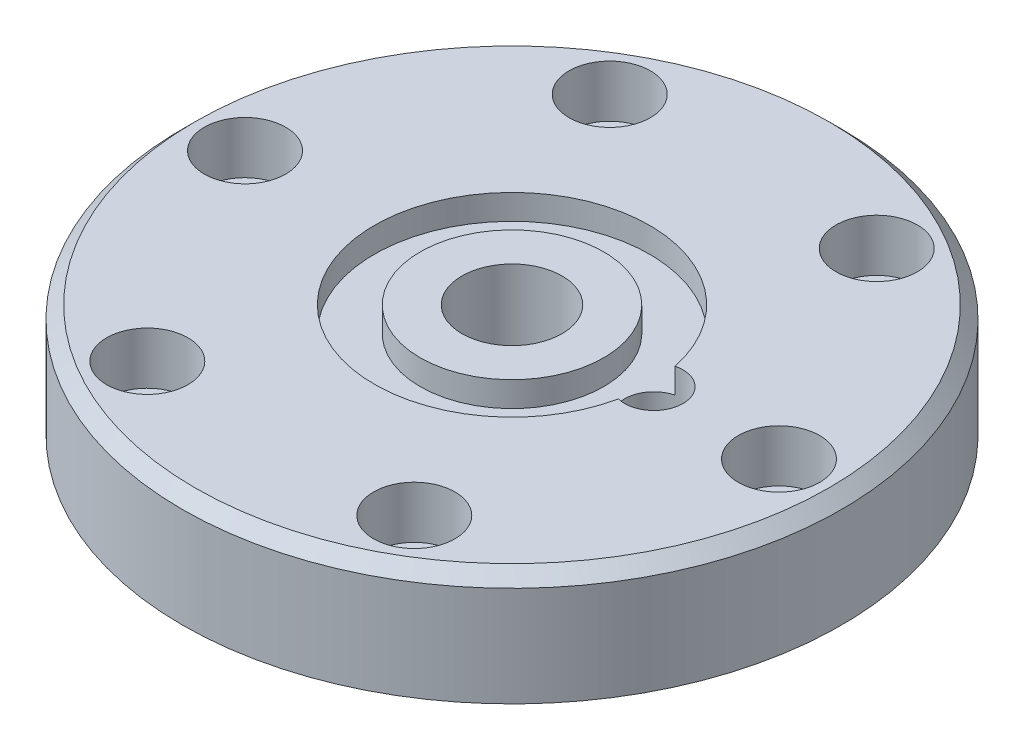
ISO-10303-21;
HEADER;
FILE_DESCRIPTION(('STEP AP214'),'2;1');
FILE_NAME('part.step','',(''),(''),'','','');
FILE_SCHEMA(('AUTOMOTIVE_DESIGN { 1 0 10303 214 1 1 1 1 }'));
ENDSEC;
DATA;
#1=APPLICATION_CONTEXT('core data for automotive mechanical design processes');
#2=APPLICATION_PROTOCOL_DEFINITION('international standard','automotive_design',2000,#1);
#3=PRODUCT_CONTEXT('',#1,'mechanical');
#4=PRODUCT('Part','Part','',(#3));
#5=PRODUCT_RELATED_PRODUCT_CATEGORY('part','',(#4));
#6=PRODUCT_DEFINITION_FORMATION('','',#4);
#7=PRODUCT_DEFINITION_CONTEXT('part definition',#1,'design');
#8=PRODUCT_DEFINITION('design','',#6,#7);
#9=PRODUCT_DEFINITION_SHAPE('','',#8);
#10=(LENGTH_UNIT() NAMED_UNIT(*) SI_UNIT(.MILLI.,.METRE.));
#11=(NAMED_UNIT(*) PLANE_ANGLE_UNIT() SI_UNIT($,.RADIAN.));
#12=(NAMED_UNIT(*) SI_UNIT($,.STERADIAN.) SOLID_ANGLE_UNIT());
#13=UNCERTAINTY_MEASURE_WITH_UNIT(LENGTH_MEASURE(1.E-05),#10,'distance_accuracy_value','');
#14=(GEOMETRIC_REPRESENTATION_CONTEXT(3) GLOBAL_UNCERTAINTY_ASSIGNED_CONTEXT((#13)) GLOBAL_UNIT_ASSIGNED_CONTEXT((#10,
#11,#12)) REPRESENTATION_CONTEXT('',''));
#15=CARTESIAN_POINT('',(0.,0.,0.));
#16=DIRECTION('',(0.,0.,1.));
#17=DIRECTION('',(1.,0.,0.));
#18=AXIS2_PLACEMENT_3D('',#15,#16,#17);
#19=CARTESIAN_POINT('',(0.,27.,0.));
#20=DIRECTION('',(0.,1.,0.));
#21=DIRECTION('',(0.,0.,1.));
#22=AXIS2_PLACEMENT_3D('',#19,#20,#21);
#23=PLANE('',#22);
#24=CARTESIAN_POINT('',(0.,27.,0.));
#25=DIRECTION('',(0.,1.,0.));
#26=DIRECTION('',(0.,0.,1.));
#27=AXIS2_PLACEMENT_3D('',#24,#25,#26);
#28=CIRCLE('',#27,12.);
#29=CARTESIAN_POINT('',(0.,27.,12.));
#30=VERTEX_POINT('',#29);
#31=EDGE_CURVE('E194',#30,#30,#28,.T.);
#32=ORIENTED_EDGE('',*,*,#31,.F.);
#33=EDGE_LOOP('',(#32));
#34=FACE_BOUND('',#33,.T.);
#35=CARTESIAN_POINT('',(0.,27.,0.));
#36=DIRECTION('',(0.,1.,0.));
#37=DIRECTION('',(0.,0.,1.));
#38=AXIS2_PLACEMENT_3D('',#35,#36,#37);
#39=CIRCLE('',#38,22.);
#40=CARTESIAN_POINT('',(0.,27.,22.));
#41=VERTEX_POINT('',#40);
#42=EDGE_CURVE('E345',#41,#41,#39,.T.);
#43=ORIENTED_EDGE('',*,*,#42,.T.);
#44=EDGE_LOOP('',(#43));
#45=FACE_BOUND('',#44,.T.);
#46=ADVANCED_FACE('F38',(#34,#45),#23,.T.);
#47=CARTESIAN_POINT('',(0.,27.,0.));
#48=DIRECTION('',(0.,1.,0.));
#49=DIRECTION('',(0.,0.,1.));
#50=AXIS2_PLACEMENT_3D('',#47,#48,#49);
#51=CIRCLE('',#50,76.);
#52=CARTESIAN_POINT('',(0.,27.,76.));
#53=VERTEX_POINT('',#52);
#54=EDGE_CURVE('E47',#53,#53,#51,.T.);
#55=ORIENTED_EDGE('',*,*,#54,.T.);
#56=EDGE_LOOP('',(#55));
#57=FACE_BOUND('',#56,.T.);
#58=CARTESIAN_POINT('',(0.,27.,0.));
#59=DIRECTION('',(0.,1.,0.));
#60=DIRECTION('',(0.,0.,1.));
#61=AXIS2_PLACEMENT_3D('',#58,#59,#60);
#62=CIRCLE('',#61,33.);
#63=CARTESIAN_POINT('',(32.2941176532353,27.,-6.78895905120929));
#64=VERTEX_POINT('',#63);
#65=CARTESIAN_POINT('',(32.2941176532353,27.,6.78895905120929));
#66=VERTEX_POINT('',#65);
#67=EDGE_CURVE('E67',#64,#66,#62,.T.);
#68=ORIENTED_EDGE('',*,*,#67,.F.);
#69=CARTESIAN_POINT('',(34.,27.,0.));
#70=DIRECTION('',(0.,1.,0.));
#71=DIRECTION('',(0.,0.,1.));
#72=AXIS2_PLACEMENT_3D('',#69,#70,#71);
#73=CIRCLE('',#72,6.99999996999999);
#74=EDGE_CURVE('E82',#66,#64,#73,.T.);
#75=ORIENTED_EDGE('',*,*,#74,.F.);
#76=EDGE_LOOP('',(#68,#75));
#77=FACE_BOUND('',#76,.T.);
#78=CARTESIAN_POINT('',(31.9999999999999,27.0000000000001,-55.4256258422042));
#79=DIRECTION('',(0.,1.,0.));
#80=DIRECTION('',(0.,0.,1.));
#81=AXIS2_PLACEMENT_3D('',#78,#79,#80);
#82=CIRCLE('',#81,9.75000005799995);
#83=CARTESIAN_POINT('',(31.9999999999999,27.0000000000001,-45.6756257842042));
#84=VERTEX_POINT('',#83);
#85=EDGE_CURVE('E94',#84,#84,#82,.T.);
#86=ORIENTED_EDGE('',*,*,#85,.F.);
#87=EDGE_LOOP('',(#86));
#88=FACE_BOUND('',#87,.T.);
#89=CARTESIAN_POINT('',(64.0000000000016,27.0000000000001,-1.0521005250614E-12));
#90=DIRECTION('',(0.,1.,0.));
#91=DIRECTION('',(0.,0.,1.));
#92=AXIS2_PLACEMENT_3D('',#89,#90,#91);
#93=CIRCLE('',#92,9.75000005799995);
#94=CARTESIAN_POINT('',(64.0000000000016,27.0000000000001,9.7500000579989));
#95=VERTEX_POINT('',#94);
#96=EDGE_CURVE('E113',#95,#95,#93,.T.);
#97=ORIENTED_EDGE('',*,*,#96,.F.);
#98=EDGE_LOOP('',(#97));
#99=FACE_BOUND('',#98,.T.);
#100=CARTESIAN_POINT('',(32.0000000000033,27.0000000000001,55.425625842204));
#101=DIRECTION('',(0.,1.,0.));
#102=DIRECTION('',(0.,0.,1.));
#103=AXIS2_PLACEMENT_3D('',#100,#101,#102);
#104=CIRCLE('',#103,9.75000005799995);
#105=CARTESIAN_POINT('',(32.0000000000033,27.0000000000001,65.175625900204));
#106=VERTEX_POINT('',#105);
#107=EDGE_CURVE('E129',#106,#106,#104,.T.);
#108=ORIENTED_EDGE('',*,*,#107,.F.);
#109=EDGE_LOOP('',(#108));
#110=FACE_BOUND('',#109,.T.);
#111=CARTESIAN_POINT('',(-31.9999999999968,27.0000000000001,55.425625842206));
#112=DIRECTION('',(0.,1.,0.));
#113=DIRECTION('',(0.,0.,1.));
#114=AXIS2_PLACEMENT_3D('',#111,#112,#113);
#115=CIRCLE('',#114,9.75000005799995);
#116=CARTESIAN_POINT('',(-31.9999999999968,27.0000000000001,65.175625900206));
#117=VERTEX_POINT('',#116);
#118=EDGE_CURVE('E145',#117,#117,#115,.T.);
#119=ORIENTED_EDGE('',*,*,#118,.F.);
#120=EDGE_LOOP('',(#119));
#121=FACE_BOUND('',#120,.T.);
#122=CARTESIAN_POINT('',(-63.9999999999985,27.0000000000001,2.90478519740463E-12));
#123=DIRECTION('',(0.,1.,0.));
#124=DIRECTION('',(0.,0.,1.));
#125=AXIS2_PLACEMENT_3D('',#122,#123,#124);
#126=CIRCLE('',#125,9.75000005799995);
#127=CARTESIAN_POINT('',(-63.9999999999985,27.0000000000001,9.75000005800285));
#128=VERTEX_POINT('',#127);
#129=EDGE_CURVE('E161',#128,#128,#126,.T.);
#130=ORIENTED_EDGE('',*,*,#129,.F.);
#131=EDGE_LOOP('',(#130));
#132=FACE_BOUND('',#131,.T.);
#133=CARTESIAN_POINT('',(-32.0000000000002,27.0000000000001,-55.4256258422022));
#134=DIRECTION('',(0.,1.,0.));
#135=DIRECTION('',(0.,0.,1.));
#136=AXIS2_PLACEMENT_3D('',#133,#134,#135);
#137=CIRCLE('',#136,9.75000005799995);
#138=CARTESIAN_POINT('',(-32.0000000000002,27.0000000000001,-45.6756257842023));
#139=VERTEX_POINT('',#138);
#140=EDGE_CURVE('E177',#139,#139,#137,.T.);
#141=ORIENTED_EDGE('',*,*,#140,.F.);
#142=EDGE_LOOP('',(#141));
#143=FACE_BOUND('',#142,.T.);
#144=ADVANCED_FACE('F86',(#57,#77,#88,#99,#110,#121,#132,#143),#23,.T.);
#145=CARTESIAN_POINT('',(0.,0.,0.));
#146=DIRECTION('',(0.,1.,0.));
#147=DIRECTION('',(0.,0.,1.));
#148=AXIS2_PLACEMENT_3D('',#145,#146,#147);
#149=PLANE('',#148);
#150=CARTESIAN_POINT('',(31.9999999999999,0.,-55.4256258422042));
#151=DIRECTION('',(0.,1.,0.));
#152=DIRECTION('',(0.,0.,1.));
#153=AXIS2_PLACEMENT_3D('',#150,#151,#152);
#154=CIRCLE('',#153,6.24999994599999);
#155=CARTESIAN_POINT('',(31.9999999999999,0.,-49.1756258962042));
#156=VERTEX_POINT('',#155);
#157=EDGE_CURVE('E109',#156,#156,#154,.T.);
#158=ORIENTED_EDGE('',*,*,#157,.T.);
#159=EDGE_LOOP('',(#158));
#160=FACE_BOUND('',#159,.T.);
#161=CARTESIAN_POINT('',(64.0000000000016,0.,-1.0521005250614E-12));
#162=DIRECTION('',(0.,1.,0.));
#163=DIRECTION('',(0.,0.,1.));
#164=AXIS2_PLACEMENT_3D('',#161,#162,#163);
#165=CIRCLE('',#164,6.24999994599999);
#166=CARTESIAN_POINT('',(64.0000000000016,0.,6.24999994599894));
#167=VERTEX_POINT('',#166);
#168=EDGE_CURVE('E125',#167,#167,#165,.T.);
#169=ORIENTED_EDGE('',*,*,#168,.T.);
#170=EDGE_LOOP('',(#169));
#171=FACE_BOUND('',#170,.T.);
#172=CARTESIAN_POINT('',(32.0000000000033,0.,55.425625842204));
#173=DIRECTION('',(0.,1.,0.));
#174=DIRECTION('',(0.,0.,1.));
#175=AXIS2_PLACEMENT_3D('',#172,#173,#174);
#176=CIRCLE('',#175,6.24999994599999);
#177=CARTESIAN_POINT('',(32.0000000000033,0.,61.675625788204));
#178=VERTEX_POINT('',#177);
#179=EDGE_CURVE('E141',#178,#178,#176,.T.);
#180=ORIENTED_EDGE('',*,*,#179,.T.);
#181=EDGE_LOOP('',(#180));
#182=FACE_BOUND('',#181,.T.);
#183=CARTESIAN_POINT('',(-31.9999999999968,0.,55.425625842206));
#184=DIRECTION('',(0.,1.,0.));
#185=DIRECTION('',(0.,0.,1.));
#186=AXIS2_PLACEMENT_3D('',#183,#184,#185);
#187=CIRCLE('',#186,6.24999994599999);
#188=CARTESIAN_POINT('',(-31.9999999999968,0.,61.675625788206));
#189=VERTEX_POINT('',#188);
#190=EDGE_CURVE('E157',#189,#189,#187,.T.);
#191=ORIENTED_EDGE('',*,*,#190,.T.);
#192=EDGE_LOOP('',(#191));
#193=FACE_BOUND('',#192,.T.);
#194=CARTESIAN_POINT('',(-63.9999999999985,0.,2.90478519740463E-12));
#195=DIRECTION('',(0.,1.,0.));
#196=DIRECTION('',(0.,0.,1.));
#197=AXIS2_PLACEMENT_3D('',#194,#195,#196);
#198=CIRCLE('',#197,6.24999994599999);
#199=CARTESIAN_POINT('',(-63.9999999999985,0.,6.2499999460029));
#200=VERTEX_POINT('',#199);
#201=EDGE_CURVE('E173',#200,#200,#198,.T.);
#202=ORIENTED_EDGE('',*,*,#201,.T.);
#203=EDGE_LOOP('',(#202));
#204=FACE_BOUND('',#203,.T.);
#205=CARTESIAN_POINT('',(-32.0000000000002,0.,-55.4256258422022));
#206=DIRECTION('',(0.,1.,0.));
#207=DIRECTION('',(0.,0.,1.));
#208=AXIS2_PLACEMENT_3D('',#205,#206,#207);
#209=CIRCLE('',#208,6.24999994599999);
#210=CARTESIAN_POINT('',(-32.0000000000002,0.,-49.1756258962022));
#211=VERTEX_POINT('',#210);
#212=EDGE_CURVE('E189',#211,#211,#209,.T.);
#213=ORIENTED_EDGE('',*,*,#212,.T.);
#214=EDGE_LOOP('',(#213));
#215=FACE_BOUND('',#214,.T.);
#216=CARTESIAN_POINT('',(0.,0.,0.));
#217=DIRECTION('',(0.,1.,0.));
#218=DIRECTION('',(0.,0.,1.));
#219=AXIS2_PLACEMENT_3D('',#216,#217,#218);
#220=CIRCLE('',#219,79.);
#221=CARTESIAN_POINT('',(0.,0.,79.));
#222=VERTEX_POINT('',#221);
#223=EDGE_CURVE('E198',#222,#222,#220,.T.);
#224=ORIENTED_EDGE('',*,*,#223,.F.);
#225=EDGE_LOOP('',(#224));
#226=FACE_BOUND('',#225,.T.);
#227=CARTESIAN_POINT('',(0.,0.,0.));
#228=DIRECTION('',(0.,1.,0.));
#229=DIRECTION('',(0.,0.,1.));
#230=AXIS2_PLACEMENT_3D('',#227,#228,#229);
#231=CIRCLE('',#230,12.);
#232=CARTESIAN_POINT('',(0.,0.,12.));
#233=VERTEX_POINT('',#232);
#234=EDGE_CURVE('E193',#233,#233,#231,.T.);
#235=ORIENTED_EDGE('',*,*,#234,.T.);
#236=EDGE_LOOP('',(#235));
#237=FACE_BOUND('',#236,.T.);
#238=ADVANCED_FACE('F231',(#160,#171,#182,#193,#204,#215,#226,#237),#149,.F.);
#239=CARTESIAN_POINT('',(0.,27.,0.));
#240=DIRECTION('',(0.,-1.,0.));
#241=DIRECTION('',(0.,0.,-1.));
#242=AXIS2_PLACEMENT_3D('',#239,#240,#241);
#243=CYLINDRICAL_SURFACE('',#242,79.);
#244=CARTESIAN_POINT('',(0.,24.,0.));
#245=DIRECTION('',(0.,1.,0.));
#246=DIRECTION('',(0.,0.,1.));
#247=AXIS2_PLACEMENT_3D('',#244,#245,#246);
#248=CIRCLE('',#247,79.);
#249=CARTESIAN_POINT('',(0.,24.,79.));
#250=VERTEX_POINT('',#249);
#251=EDGE_CURVE('E11',#250,#250,#248,.F.);
#252=ORIENTED_EDGE('',*,*,#251,.T.);
#253=EDGE_LOOP('',(#252));
#254=FACE_BOUND('',#253,.T.);
#255=ORIENTED_EDGE('',*,*,#223,.T.);
#256=EDGE_LOOP('',(#255));
#257=FACE_BOUND('',#256,.T.);
#258=ADVANCED_FACE('F239',(#254,#257),#243,.T.);
#259=CARTESIAN_POINT('',(0.,27.,0.));
#260=DIRECTION('',(0.,-1.,0.));
#261=DIRECTION('',(0.,0.,-1.));
#262=AXIS2_PLACEMENT_3D('',#259,#260,#261);
#263=CYLINDRICAL_SURFACE('',#262,12.);
#264=ORIENTED_EDGE('',*,*,#31,.T.);
#265=EDGE_LOOP('',(#264));
#266=FACE_BOUND('',#265,.T.);
#267=ORIENTED_EDGE('',*,*,#234,.F.);
#268=EDGE_LOOP('',(#267));
#269=FACE_BOUND('',#268,.T.);
#270=ADVANCED_FACE('F236',(#266,#269),#263,.F.);
#271=CARTESIAN_POINT('',(-32.0000000000002,27.,-55.4256258422022));
#272=DIRECTION('',(0.,1.,0.));
#273=DIRECTION('',(0.,0.,1.));
#274=AXIS2_PLACEMENT_3D('',#271,#272,#273);
#275=CYLINDRICAL_SURFACE('',#274,6.24999994599999);
#276=ORIENTED_EDGE('',*,*,#212,.F.);
#277=EDGE_LOOP('',(#276));
#278=FACE_BOUND('',#277,.T.);
#279=CARTESIAN_POINT('',(-32.0000000000002,14.500000108,-55.4256258422022));
#280=DIRECTION('',(0.,1.,0.));
#281=DIRECTION('',(0.,0.,1.));
#282=AXIS2_PLACEMENT_3D('',#279,#280,#281);
#283=CIRCLE('',#282,6.249999946);
#284=CARTESIAN_POINT('',(-32.0000000000002,14.500000108,-49.1756258962022));
#285=VERTEX_POINT('',#284);
#286=EDGE_CURVE('E185',#285,#285,#283,.T.);
#287=ORIENTED_EDGE('',*,*,#286,.T.);
#288=EDGE_LOOP('',(#287));
#289=FACE_BOUND('',#288,.T.);
#290=ADVANCED_FACE('F246',(#278,#289),#275,.F.);
#291=CARTESIAN_POINT('',(-25.7500000540002,14.500000108,-55.4256258422022));
#292=DIRECTION('',(0.,-1.,0.));
#293=DIRECTION('',(0.,0.,-1.));
#294=AXIS2_PLACEMENT_3D('',#291,#292,#293);
#295=PLANE('',#294);
#296=ORIENTED_EDGE('',*,*,#286,.F.);
#297=EDGE_LOOP('',(#296));
#298=FACE_BOUND('',#297,.T.);
#299=CARTESIAN_POINT('',(-32.0000000000002,14.500000108,-55.4256258422022));
#300=DIRECTION('',(0.,1.,0.));
#301=DIRECTION('',(0.,0.,1.));
#302=AXIS2_PLACEMENT_3D('',#299,#300,#301);
#303=CIRCLE('',#302,9.75000005799996);
#304=CARTESIAN_POINT('',(-32.0000000000002,14.500000108,-45.6756257842022));
#305=VERTEX_POINT('',#304);
#306=EDGE_CURVE('E181',#305,#305,#303,.T.);
#307=ORIENTED_EDGE('',*,*,#306,.T.);
#308=EDGE_LOOP('',(#307));
#309=FACE_BOUND('',#308,.T.);
#310=ADVANCED_FACE('F257',(#298,#309),#295,.F.);
#311=CARTESIAN_POINT('',(-32.0000000000002,27.,-55.4256258422022));
#312=DIRECTION('',(0.,1.,0.));
#313=DIRECTION('',(0.,0.,1.));
#314=AXIS2_PLACEMENT_3D('',#311,#312,#313);
#315=CYLINDRICAL_SURFACE('',#314,9.75000005799995);
#316=ORIENTED_EDGE('',*,*,#306,.F.);
#317=EDGE_LOOP('',(#316));
#318=FACE_BOUND('',#317,.T.);
#319=ORIENTED_EDGE('',*,*,#140,.T.);
#320=EDGE_LOOP('',(#319));
#321=FACE_BOUND('',#320,.T.);
#322=ADVANCED_FACE('F262',(#318,#321),#315,.F.);
#323=CARTESIAN_POINT('',(-63.9999999999985,27.,2.90478519740463E-12));
#324=DIRECTION('',(0.,1.,0.));
#325=DIRECTION('',(0.,0.,1.));
#326=AXIS2_PLACEMENT_3D('',#323,#324,#325);
#327=CYLINDRICAL_SURFACE('',#326,6.24999994599999);
#328=ORIENTED_EDGE('',*,*,#201,.F.);
#329=EDGE_LOOP('',(#328));
#330=FACE_BOUND('',#329,.T.);
#331=CARTESIAN_POINT('',(-63.9999999999985,14.500000108,2.90478519740463E-12));
#332=DIRECTION('',(0.,1.,0.));
#333=DIRECTION('',(0.,0.,1.));
#334=AXIS2_PLACEMENT_3D('',#331,#332,#333);
#335=CIRCLE('',#334,6.24999994599999);
#336=CARTESIAN_POINT('',(-63.9999999999985,14.500000108,6.2499999460029));
#337=VERTEX_POINT('',#336);
#338=EDGE_CURVE('E169',#337,#337,#335,.T.);
#339=ORIENTED_EDGE('',*,*,#338,.T.);
#340=EDGE_LOOP('',(#339));
#341=FACE_BOUND('',#340,.T.);
#342=ADVANCED_FACE('F270',(#330,#341),#327,.F.);
#343=CARTESIAN_POINT('',(-57.7500000539985,14.500000108,2.90478519740463E-12));
#344=DIRECTION('',(0.,-1.,0.));
#345=DIRECTION('',(0.,0.,-1.));
#346=AXIS2_PLACEMENT_3D('',#343,#344,#345);
#347=PLANE('',#346);
#348=ORIENTED_EDGE('',*,*,#338,.F.);
#349=EDGE_LOOP('',(#348));
#350=FACE_BOUND('',#349,.T.);
#351=CARTESIAN_POINT('',(-63.9999999999985,14.500000108,2.90478519740463E-12));
#352=DIRECTION('',(0.,1.,0.));
#353=DIRECTION('',(0.,0.,1.));
#354=AXIS2_PLACEMENT_3D('',#351,#352,#353);
#355=CIRCLE('',#354,9.75000005799996);
#356=CARTESIAN_POINT('',(-63.9999999999985,14.500000108,9.75000005800286));
#357=VERTEX_POINT('',#356);
#358=EDGE_CURVE('E165',#357,#357,#355,.T.);
#359=ORIENTED_EDGE('',*,*,#358,.T.);
#360=EDGE_LOOP('',(#359));
#361=FACE_BOUND('',#360,.T.);
#362=ADVANCED_FACE('F274',(#350,#361),#347,.F.);
#363=CARTESIAN_POINT('',(-63.9999999999985,27.,2.90478519740463E-12));
#364=DIRECTION('',(0.,1.,0.));
#365=DIRECTION('',(0.,0.,1.));
#366=AXIS2_PLACEMENT_3D('',#363,#364,#365);
#367=CYLINDRICAL_SURFACE('',#366,9.75000005799995);
#368=ORIENTED_EDGE('',*,*,#358,.F.);
#369=EDGE_LOOP('',(#368));
#370=FACE_BOUND('',#369,.T.);
#371=ORIENTED_EDGE('',*,*,#129,.T.);
#372=EDGE_LOOP('',(#371));
#373=FACE_BOUND('',#372,.T.);
#374=ADVANCED_FACE('F278',(#370,#373),#367,.F.);
#375=CARTESIAN_POINT('',(-31.9999999999968,27.,55.425625842206));
#376=DIRECTION('',(0.,1.,0.));
#377=DIRECTION('',(0.,0.,1.));
#378=AXIS2_PLACEMENT_3D('',#375,#376,#377);
#379=CYLINDRICAL_SURFACE('',#378,6.24999994599999);
#380=ORIENTED_EDGE('',*,*,#190,.F.);
#381=EDGE_LOOP('',(#380));
#382=FACE_BOUND('',#381,.T.);
#383=CARTESIAN_POINT('',(-31.9999999999968,14.500000108,55.425625842206));
#384=DIRECTION('',(0.,1.,0.));
#385=DIRECTION('',(0.,0.,1.));
#386=AXIS2_PLACEMENT_3D('',#383,#384,#385);
#387=CIRCLE('',#386,6.249999946);
#388=CARTESIAN_POINT('',(-31.9999999999968,14.500000108,61.675625788206));
#389=VERTEX_POINT('',#388);
#390=EDGE_CURVE('E153',#389,#389,#387,.T.);
#391=ORIENTED_EDGE('',*,*,#390,.T.);
#392=EDGE_LOOP('',(#391));
#393=FACE_BOUND('',#392,.T.);
#394=ADVANCED_FACE('F282',(#382,#393),#379,.F.);
#395=CARTESIAN_POINT('',(-25.7500000539968,14.500000108,55.425625842206));
#396=DIRECTION('',(0.,-1.,0.));
#397=DIRECTION('',(0.,0.,-1.));
#398=AXIS2_PLACEMENT_3D('',#395,#396,#397);
#399=PLANE('',#398);
#400=ORIENTED_EDGE('',*,*,#390,.F.);
#401=EDGE_LOOP('',(#400));
#402=FACE_BOUND('',#401,.T.);
#403=CARTESIAN_POINT('',(-31.9999999999968,14.500000108,55.425625842206));
#404=DIRECTION('',(0.,1.,0.));
#405=DIRECTION('',(0.,0.,1.));
#406=AXIS2_PLACEMENT_3D('',#403,#404,#405);
#407=CIRCLE('',#406,9.75000005799996);
#408=CARTESIAN_POINT('',(-31.9999999999968,14.500000108,65.175625900206));
#409=VERTEX_POINT('',#408);
#410=EDGE_CURVE('E149',#409,#409,#407,.T.);
#411=ORIENTED_EDGE('',*,*,#410,.T.);
#412=EDGE_LOOP('',(#411));
#413=FACE_BOUND('',#412,.T.);
#414=ADVANCED_FACE('F286',(#402,#413),#399,.F.);
#415=CARTESIAN_POINT('',(-31.9999999999968,27.,55.425625842206));
#416=DIRECTION('',(0.,1.,0.));
#417=DIRECTION('',(0.,0.,1.));
#418=AXIS2_PLACEMENT_3D('',#415,#416,#417);
#419=CYLINDRICAL_SURFACE('',#418,9.75000005799995);
#420=ORIENTED_EDGE('',*,*,#410,.F.);
#421=EDGE_LOOP('',(#420));
#422=FACE_BOUND('',#421,.T.);
#423=ORIENTED_EDGE('',*,*,#118,.T.);
#424=EDGE_LOOP('',(#423));
#425=FACE_BOUND('',#424,.T.);
#426=ADVANCED_FACE('F290',(#422,#425),#419,.F.);
#427=CARTESIAN_POINT('',(32.0000000000033,27.,55.425625842204));
#428=DIRECTION('',(0.,1.,0.));
#429=DIRECTION('',(0.,0.,1.));
#430=AXIS2_PLACEMENT_3D('',#427,#428,#429);
#431=CYLINDRICAL_SURFACE('',#430,6.24999994599999);
#432=ORIENTED_EDGE('',*,*,#179,.F.);
#433=EDGE_LOOP('',(#432));
#434=FACE_BOUND('',#433,.T.);
#435=CARTESIAN_POINT('',(32.0000000000033,14.500000108,55.425625842204));
#436=DIRECTION('',(0.,1.,0.));
#437=DIRECTION('',(0.,0.,1.));
#438=AXIS2_PLACEMENT_3D('',#435,#436,#437);
#439=CIRCLE('',#438,6.24999994599999);
#440=CARTESIAN_POINT('',(32.0000000000033,14.500000108,61.675625788204));
#441=VERTEX_POINT('',#440);
#442=EDGE_CURVE('E137',#441,#441,#439,.T.);
#443=ORIENTED_EDGE('',*,*,#442,.T.);
#444=EDGE_LOOP('',(#443));
#445=FACE_BOUND('',#444,.T.);
#446=ADVANCED_FACE('F294',(#434,#445),#431,.F.);
#447=CARTESIAN_POINT('',(38.2499999460033,14.500000108,55.425625842204));
#448=DIRECTION('',(0.,-1.,0.));
#449=DIRECTION('',(0.,0.,-1.));
#450=AXIS2_PLACEMENT_3D('',#447,#448,#449);
#451=PLANE('',#450);
#452=ORIENTED_EDGE('',*,*,#442,.F.);
#453=EDGE_LOOP('',(#452));
#454=FACE_BOUND('',#453,.T.);
#455=CARTESIAN_POINT('',(32.0000000000033,14.500000108,55.425625842204));
#456=DIRECTION('',(0.,1.,0.));
#457=DIRECTION('',(0.,0.,1.));
#458=AXIS2_PLACEMENT_3D('',#455,#456,#457);
#459=CIRCLE('',#458,9.75000005799996);
#460=CARTESIAN_POINT('',(32.0000000000033,14.500000108,65.175625900204));
#461=VERTEX_POINT('',#460);
#462=EDGE_CURVE('E133',#461,#461,#459,.T.);
#463=ORIENTED_EDGE('',*,*,#462,.T.);
#464=EDGE_LOOP('',(#463));
#465=FACE_BOUND('',#464,.T.);
#466=ADVANCED_FACE('F298',(#454,#465),#451,.F.);
#467=CARTESIAN_POINT('',(32.0000000000033,27.,55.425625842204));
#468=DIRECTION('',(0.,1.,0.));
#469=DIRECTION('',(0.,0.,1.));
#470=AXIS2_PLACEMENT_3D('',#467,#468,#469);
#471=CYLINDRICAL_SURFACE('',#470,9.75000005799995);
#472=ORIENTED_EDGE('',*,*,#462,.F.);
#473=EDGE_LOOP('',(#472));
#474=FACE_BOUND('',#473,.T.);
#475=ORIENTED_EDGE('',*,*,#107,.T.);
#476=EDGE_LOOP('',(#475));
#477=FACE_BOUND('',#476,.T.);
#478=ADVANCED_FACE('F302',(#474,#477),#471,.F.);
#479=CARTESIAN_POINT('',(64.0000000000016,27.,-1.0521005250614E-12));
#480=DIRECTION('',(0.,1.,0.));
#481=DIRECTION('',(0.,0.,1.));
#482=AXIS2_PLACEMENT_3D('',#479,#480,#481);
#483=CYLINDRICAL_SURFACE('',#482,6.24999994599999);
#484=ORIENTED_EDGE('',*,*,#168,.F.);
#485=EDGE_LOOP('',(#484));
#486=FACE_BOUND('',#485,.T.);
#487=CARTESIAN_POINT('',(64.0000000000016,14.500000108,-1.0521005250614E-12));
#488=DIRECTION('',(0.,1.,0.));
#489=DIRECTION('',(0.,0.,1.));
#490=AXIS2_PLACEMENT_3D('',#487,#488,#489);
#491=CIRCLE('',#490,6.24999994599999);
#492=CARTESIAN_POINT('',(64.0000000000016,14.500000108,6.24999994599894));
#493=VERTEX_POINT('',#492);
#494=EDGE_CURVE('E121',#493,#493,#491,.T.);
#495=ORIENTED_EDGE('',*,*,#494,.T.);
#496=EDGE_LOOP('',(#495));
#497=FACE_BOUND('',#496,.T.);
#498=ADVANCED_FACE('F306',(#486,#497),#483,.F.);
#499=CARTESIAN_POINT('',(70.2499999460016,14.500000108,-1.0521005250614E-12));
#500=DIRECTION('',(0.,-1.,0.));
#501=DIRECTION('',(0.,0.,-1.));
#502=AXIS2_PLACEMENT_3D('',#499,#500,#501);
#503=PLANE('',#502);
#504=ORIENTED_EDGE('',*,*,#494,.F.);
#505=EDGE_LOOP('',(#504));
#506=FACE_BOUND('',#505,.T.);
#507=CARTESIAN_POINT('',(64.0000000000016,14.500000108,-1.0521005250614E-12));
#508=DIRECTION('',(0.,1.,0.));
#509=DIRECTION('',(0.,0.,1.));
#510=AXIS2_PLACEMENT_3D('',#507,#508,#509);
#511=CIRCLE('',#510,9.75000005799996);
#512=CARTESIAN_POINT('',(64.0000000000016,14.500000108,9.75000005799891));
#513=VERTEX_POINT('',#512);
#514=EDGE_CURVE('E117',#513,#513,#511,.T.);
#515=ORIENTED_EDGE('',*,*,#514,.T.);
#516=EDGE_LOOP('',(#515));
#517=FACE_BOUND('',#516,.T.);
#518=ADVANCED_FACE('F310',(#506,#517),#503,.F.);
#519=CARTESIAN_POINT('',(64.0000000000016,27.,-1.0521005250614E-12));
#520=DIRECTION('',(0.,1.,0.));
#521=DIRECTION('',(0.,0.,1.));
#522=AXIS2_PLACEMENT_3D('',#519,#520,#521);
#523=CYLINDRICAL_SURFACE('',#522,9.75000005799995);
#524=ORIENTED_EDGE('',*,*,#514,.F.);
#525=EDGE_LOOP('',(#524));
#526=FACE_BOUND('',#525,.T.);
#527=ORIENTED_EDGE('',*,*,#96,.T.);
#528=EDGE_LOOP('',(#527));
#529=FACE_BOUND('',#528,.T.);
#530=ADVANCED_FACE('F314',(#526,#529),#523,.F.);
#531=CARTESIAN_POINT('',(31.9999999999999,27.,-55.4256258422042));
#532=DIRECTION('',(0.,1.,0.));
#533=DIRECTION('',(0.,0.,1.));
#534=AXIS2_PLACEMENT_3D('',#531,#532,#533);
#535=CYLINDRICAL_SURFACE('',#534,6.24999994599999);
#536=ORIENTED_EDGE('',*,*,#157,.F.);
#537=EDGE_LOOP('',(#536));
#538=FACE_BOUND('',#537,.T.);
#539=CARTESIAN_POINT('',(31.9999999999999,14.500000108,-55.4256258422042));
#540=DIRECTION('',(0.,1.,0.));
#541=DIRECTION('',(0.,0.,1.));
#542=AXIS2_PLACEMENT_3D('',#539,#540,#541);
#543=CIRCLE('',#542,6.24999994599999);
#544=CARTESIAN_POINT('',(31.9999999999999,14.500000108,-49.1756258962042));
#545=VERTEX_POINT('',#544);
#546=EDGE_CURVE('E105',#545,#545,#543,.T.);
#547=ORIENTED_EDGE('',*,*,#546,.T.);
#548=EDGE_LOOP('',(#547));
#549=FACE_BOUND('',#548,.T.);
#550=ADVANCED_FACE('F318',(#538,#549),#535,.F.);
#551=CARTESIAN_POINT('',(38.2499999459999,14.500000108,-55.4256258422042));
#552=DIRECTION('',(0.,-1.,0.));
#553=DIRECTION('',(0.,0.,-1.));
#554=AXIS2_PLACEMENT_3D('',#551,#552,#553);
#555=PLANE('',#554);
#556=ORIENTED_EDGE('',*,*,#546,.F.);
#557=EDGE_LOOP('',(#556));
#558=FACE_BOUND('',#557,.T.);
#559=CARTESIAN_POINT('',(31.9999999999999,14.500000108,-55.4256258422042));
#560=DIRECTION('',(0.,1.,0.));
#561=DIRECTION('',(0.,0.,1.));
#562=AXIS2_PLACEMENT_3D('',#559,#560,#561);
#563=CIRCLE('',#562,9.75000005799996);
#564=CARTESIAN_POINT('',(31.9999999999999,14.500000108,-45.6756257842042));
#565=VERTEX_POINT('',#564);
#566=EDGE_CURVE('E101',#565,#565,#563,.T.);
#567=ORIENTED_EDGE('',*,*,#566,.T.);
#568=EDGE_LOOP('',(#567));
#569=FACE_BOUND('',#568,.T.);
#570=ADVANCED_FACE('F322',(#558,#569),#555,.F.);
#571=CARTESIAN_POINT('',(31.9999999999999,27.,-55.4256258422042));
#572=DIRECTION('',(0.,1.,0.));
#573=DIRECTION('',(0.,0.,1.));
#574=AXIS2_PLACEMENT_3D('',#571,#572,#573);
#575=CYLINDRICAL_SURFACE('',#574,9.75000005799995);
#576=ORIENTED_EDGE('',*,*,#566,.F.);
#577=EDGE_LOOP('',(#576));
#578=FACE_BOUND('',#577,.T.);
#579=ORIENTED_EDGE('',*,*,#85,.T.);
#580=EDGE_LOOP('',(#579));
#581=FACE_BOUND('',#580,.T.);
#582=ADVANCED_FACE('F326',(#578,#581),#575,.F.);
#583=CARTESIAN_POINT('',(34.,10.,0.));
#584=DIRECTION('',(0.,1.,0.));
#585=DIRECTION('',(0.,0.,1.));
#586=AXIS2_PLACEMENT_3D('',#583,#584,#585);
#587=CONICAL_SURFACE('',#586,6.99999997,1.02974425867665);
#588=CARTESIAN_POINT('',(34.,5.79397568483289,0.));
#589=VERTEX_POINT('',#588);
#590=VERTEX_LOOP('',#589);
#591=FACE_BOUND('',#590,.T.);
#592=CARTESIAN_POINT('',(34.,10.,0.));
#593=DIRECTION('',(0.,1.,0.));
#594=DIRECTION('',(0.,0.,1.));
#595=AXIS2_PLACEMENT_3D('',#592,#593,#594);
#596=CIRCLE('',#595,6.99999997);
#597=CARTESIAN_POINT('',(34.,10.,6.99999997));
#598=VERTEX_POINT('',#597);
#599=EDGE_CURVE('E89',#598,#598,#596,.T.);
#600=ORIENTED_EDGE('',*,*,#599,.T.);
#601=EDGE_LOOP('',(#600));
#602=FACE_BOUND('',#601,.T.);
#603=ADVANCED_FACE('F330',(#591,#602),#587,.F.);
#604=CARTESIAN_POINT('',(34.,27.,0.));
#605=DIRECTION('',(0.,1.,0.));
#606=DIRECTION('',(0.,0.,1.));
#607=AXIS2_PLACEMENT_3D('',#604,#605,#606);
#608=CYLINDRICAL_SURFACE('',#607,6.99999996999999);
#609=ORIENTED_EDGE('',*,*,#599,.F.);
#610=EDGE_LOOP('',(#609));
#611=FACE_BOUND('',#610,.T.);
#612=CARTESIAN_POINT('',(34.,21.,0.));
#613=DIRECTION('',(0.,1.,0.));
#614=DIRECTION('',(0.,0.,1.));
#615=AXIS2_PLACEMENT_3D('',#612,#613,#614);
#616=CIRCLE('',#615,6.99999996999999);
#617=CARTESIAN_POINT('',(32.2941176532353,21.,6.78895905120929));
#618=VERTEX_POINT('',#617);
#619=CARTESIAN_POINT('',(32.2941176532353,21.,-6.78895905120929));
#620=VERTEX_POINT('',#619);
#621=EDGE_CURVE('E83',#618,#620,#616,.F.);
#622=ORIENTED_EDGE('',*,*,#621,.F.);
#623=DIRECTION('',(0.,1.,0.));
#624=VECTOR('',#623,1.);
#625=CARTESIAN_POINT('',(32.2941176532353,24.,6.78895905120928));
#626=LINE('',#625,#624);
#627=EDGE_CURVE('E70',#618,#66,#626,.T.);
#628=ORIENTED_EDGE('',*,*,#627,.T.);
#629=ORIENTED_EDGE('',*,*,#74,.T.);
#630=DIRECTION('',(0.,1.,0.));
#631=VECTOR('',#630,1.);
#632=CARTESIAN_POINT('',(32.2941176532353,24.,-6.78895905120928));
#633=LINE('',#632,#631);
#634=EDGE_CURVE('E73',#64,#620,#633,.F.);
#635=ORIENTED_EDGE('',*,*,#634,.T.);
#636=EDGE_LOOP('',(#622,#628,#629,#635));
#637=FACE_BOUND('',#636,.T.);
#638=ADVANCED_FACE('F81',(#611,#637),#608,.F.);
#639=CARTESIAN_POINT('',(0.,21.,0.));
#640=DIRECTION('',(0.,1.,0.));
#641=DIRECTION('',(0.,0.,1.));
#642=AXIS2_PLACEMENT_3D('',#639,#640,#641);
#643=CYLINDRICAL_SURFACE('',#642,33.);
#644=CARTESIAN_POINT('',(0.,21.,0.));
#645=DIRECTION('',(0.,1.,0.));
#646=DIRECTION('',(0.,0.,1.));
#647=AXIS2_PLACEMENT_3D('',#644,#645,#646);
#648=CIRCLE('',#647,33.);
#649=EDGE_CURVE('E53',#620,#618,#648,.T.);
#650=ORIENTED_EDGE('',*,*,#649,.F.);
#651=ORIENTED_EDGE('',*,*,#634,.F.);
#652=ORIENTED_EDGE('',*,*,#67,.T.);
#653=ORIENTED_EDGE('',*,*,#627,.F.);
#654=EDGE_LOOP('',(#650,#651,#652,#653));
#655=FACE_BOUND('',#654,.T.);
#656=ADVANCED_FACE('F69',(#655),#643,.F.);
#657=CARTESIAN_POINT('',(0.,21.,0.));
#658=DIRECTION('',(0.,1.,0.));
#659=DIRECTION('',(0.,0.,1.));
#660=AXIS2_PLACEMENT_3D('',#657,#658,#659);
#661=PLANE('',#660);
#662=CARTESIAN_POINT('',(0.,21.,0.));
#663=DIRECTION('',(0.,1.,0.));
#664=DIRECTION('',(0.,0.,1.));
#665=AXIS2_PLACEMENT_3D('',#662,#663,#664);
#666=CIRCLE('',#665,22.);
#667=CARTESIAN_POINT('',(0.,21.,22.));
#668=VERTEX_POINT('',#667);
#669=EDGE_CURVE('E78',#668,#668,#666,.T.);
#670=ORIENTED_EDGE('',*,*,#669,.F.);
#671=EDGE_LOOP('',(#670));
#672=FACE_BOUND('',#671,.T.);
#673=ORIENTED_EDGE('',*,*,#621,.T.);
#674=ORIENTED_EDGE('',*,*,#649,.T.);
#675=EDGE_LOOP('',(#673,#674));
#676=FACE_BOUND('',#675,.T.);
#677=ADVANCED_FACE('F219',(#672,#676),#661,.T.);
#678=CARTESIAN_POINT('',(0.,21.,0.));
#679=DIRECTION('',(0.,1.,0.));
#680=DIRECTION('',(0.,0.,1.));
#681=AXIS2_PLACEMENT_3D('',#678,#679,#680);
#682=CYLINDRICAL_SURFACE('',#681,22.);
#683=ORIENTED_EDGE('',*,*,#669,.T.);
#684=EDGE_LOOP('',(#683));
#685=FACE_BOUND('',#684,.T.);
#686=ORIENTED_EDGE('',*,*,#42,.F.);
#687=EDGE_LOOP('',(#686));
#688=FACE_BOUND('',#687,.T.);
#689=ADVANCED_FACE('F214',(#685,#688),#682,.T.);
#690=CARTESIAN_POINT('',(0.,27.,0.));
#691=DIRECTION('',(0.,-1.,0.));
#692=DIRECTION('',(0.,0.,-1.));
#693=AXIS2_PLACEMENT_3D('',#690,#691,#692);
#694=CONICAL_SURFACE('',#693,76.,0.785398163397448);
#695=ORIENTED_EDGE('',*,*,#251,.F.);
#696=EDGE_LOOP('',(#695));
#697=FACE_BOUND('',#696,.T.);
#698=ORIENTED_EDGE('',*,*,#54,.F.);
#699=EDGE_LOOP('',(#698));
#700=FACE_BOUND('',#699,.T.);
#701=ADVANCED_FACE('F40',(#697,#700),#694,.T.);
#702=CLOSED_SHELL('',(#46,#144,#238,#258,#270,#290,#310,#322,#342,#362,#374,#394,#414,#426,#446,
#466,#478,#498,#518,#530,#550,#570,#582,#603,#638,#656,#677,#689,#701));
#703=MANIFOLD_SOLID_BREP('B2',#702);
#704=ADVANCED_BREP_SHAPE_REPRESENTATION('',(#18,#703),#14);
#705=SHAPE_DEFINITION_REPRESENTATION(#9,#704);
ENDSEC;
END-ISO-10303-21;
